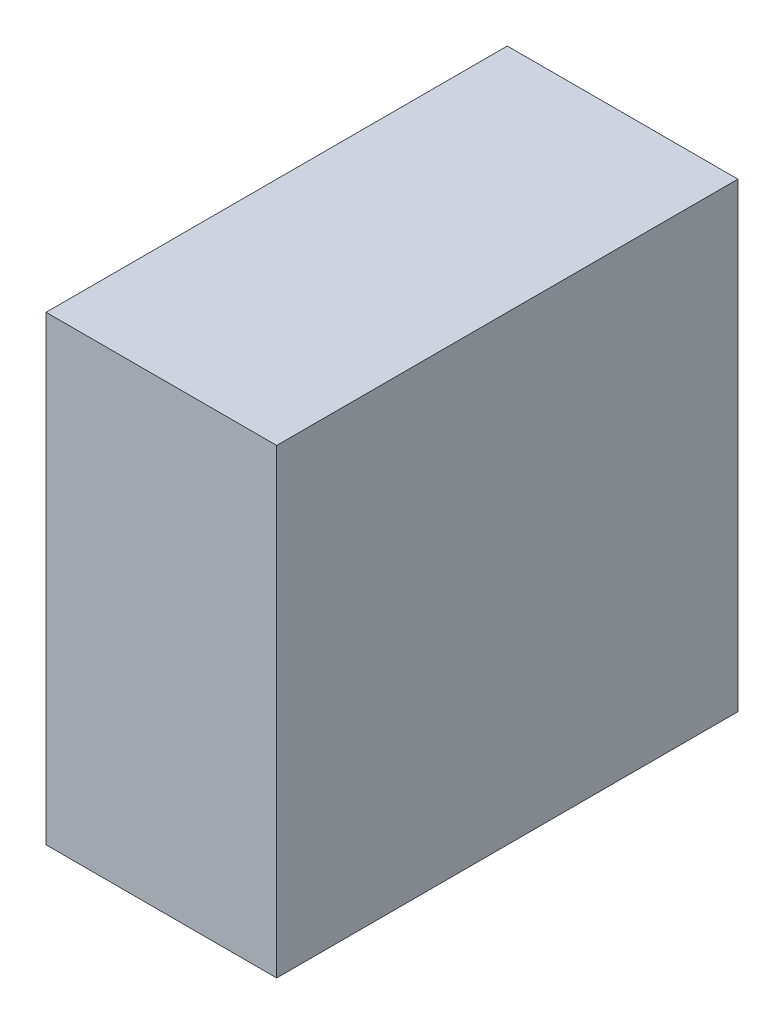
ISO-10303-21;
HEADER;
FILE_DESCRIPTION(('STEP AP214'),'2;1');
FILE_NAME('part.step','',(''),(''),'','','');
FILE_SCHEMA(('AUTOMOTIVE_DESIGN { 1 0 10303 214 1 1 1 1 }'));
ENDSEC;
DATA;
#1=APPLICATION_CONTEXT('core data for automotive mechanical design processes');
#2=APPLICATION_PROTOCOL_DEFINITION('international standard','automotive_design',2000,#1);
#3=PRODUCT_CONTEXT('',#1,'mechanical');
#4=PRODUCT('Part','Part','',(#3));
#5=PRODUCT_RELATED_PRODUCT_CATEGORY('part','',(#4));
#6=PRODUCT_DEFINITION_FORMATION('','',#4);
#7=PRODUCT_DEFINITION_CONTEXT('part definition',#1,'design');
#8=PRODUCT_DEFINITION('design','',#6,#7);
#9=PRODUCT_DEFINITION_SHAPE('','',#8);
#10=(LENGTH_UNIT() NAMED_UNIT(*) SI_UNIT(.MILLI.,.METRE.));
#11=(NAMED_UNIT(*) PLANE_ANGLE_UNIT() SI_UNIT($,.RADIAN.));
#12=(NAMED_UNIT(*) SI_UNIT($,.STERADIAN.) SOLID_ANGLE_UNIT());
#13=UNCERTAINTY_MEASURE_WITH_UNIT(LENGTH_MEASURE(1.E-05),#10,'distance_accuracy_value','');
#14=(GEOMETRIC_REPRESENTATION_CONTEXT(3) GLOBAL_UNCERTAINTY_ASSIGNED_CONTEXT((#13)) GLOBAL_UNIT_ASSIGNED_CONTEXT((#10,
#11,#12)) REPRESENTATION_CONTEXT('',''));
#15=CARTESIAN_POINT('',(0.,0.,0.));
#16=DIRECTION('',(0.,0.,1.));
#17=DIRECTION('',(1.,0.,0.));
#18=AXIS2_PLACEMENT_3D('',#15,#16,#17);
#19=CARTESIAN_POINT('',(0.,0.,0.));
#20=DIRECTION('',(0.894427190999916,-0.447213595499958,0.));
#21=DIRECTION('',(0.447213595499958,0.894427190999916,0.));
#22=AXIS2_PLACEMENT_3D('',#19,#20,#21);
#23=PLANE('',#22);
#24=DIRECTION('',(-0.447213595499958,-0.894427190999916,0.));
#25=VECTOR('',#24,1.);
#26=CARTESIAN_POINT('',(0.,0.,20.));
#27=LINE('',#26,#25);
#28=CARTESIAN_POINT('',(20.,40.,20.));
#29=VERTEX_POINT('',#28);
#30=CARTESIAN_POINT('',(0.,0.,20.));
#31=VERTEX_POINT('',#30);
#32=EDGE_CURVE('E81',#29,#31,#27,.T.);
#33=ORIENTED_EDGE('',*,*,#32,.F.);
#34=DIRECTION('',(0.,0.,1.));
#35=VECTOR('',#34,1.);
#36=CARTESIAN_POINT('',(20.,40.,0.));
#37=LINE('',#36,#35);
#38=CARTESIAN_POINT('',(20.,40.,0.));
#39=VERTEX_POINT('',#38);
#40=EDGE_CURVE('E56',#39,#29,#37,.T.);
#41=ORIENTED_EDGE('',*,*,#40,.F.);
#42=DIRECTION('',(0.447213595499958,0.894427190999916,0.));
#43=VECTOR('',#42,1.);
#44=CARTESIAN_POINT('',(0.,0.,0.));
#45=LINE('',#44,#43);
#46=CARTESIAN_POINT('',(0.,0.,0.));
#47=VERTEX_POINT('',#46);
#48=EDGE_CURVE('E93',#47,#39,#45,.T.);
#49=ORIENTED_EDGE('',*,*,#48,.F.);
#50=DIRECTION('',(0.,0.,-1.));
#51=VECTOR('',#50,1.);
#52=CARTESIAN_POINT('',(0.,0.,40.));
#53=LINE('',#52,#51);
#54=EDGE_CURVE('E11',#31,#47,#53,.T.);
#55=ORIENTED_EDGE('',*,*,#54,.F.);
#56=EDGE_LOOP('',(#33,#41,#49,#55));
#57=FACE_BOUND('',#56,.T.);
#58=ADVANCED_FACE('F33',(#57),#23,.F.);
#59=CARTESIAN_POINT('',(0.,0.,40.));
#60=DIRECTION('',(0.,1.,0.));
#61=DIRECTION('',(0.,0.,1.));
#62=AXIS2_PLACEMENT_3D('',#59,#60,#61);
#63=PLANE('',#62);
#64=DIRECTION('',(1.,0.,0.));
#65=VECTOR('',#64,1.);
#66=CARTESIAN_POINT('',(0.,0.,40.));
#67=LINE('',#66,#65);
#68=CARTESIAN_POINT('',(20.,0.,40.));
#69=VERTEX_POINT('',#68);
#70=CARTESIAN_POINT('',(40.,0.,40.));
#71=VERTEX_POINT('',#70);
#72=EDGE_CURVE('E115',#69,#71,#67,.T.);
#73=ORIENTED_EDGE('',*,*,#72,.F.);
#74=DIRECTION('',(0.,0.,1.));
#75=VECTOR('',#74,1.);
#76=CARTESIAN_POINT('',(20.,0.,20.));
#77=LINE('',#76,#75);
#78=CARTESIAN_POINT('',(20.,0.,20.));
#79=VERTEX_POINT('',#78);
#80=EDGE_CURVE('E91',#79,#69,#77,.T.);
#81=ORIENTED_EDGE('',*,*,#80,.F.);
#82=DIRECTION('',(1.,0.,0.));
#83=VECTOR('',#82,1.);
#84=CARTESIAN_POINT('',(20.,0.,20.));
#85=LINE('',#84,#83);
#86=EDGE_CURVE('E84',#31,#79,#85,.T.);
#87=ORIENTED_EDGE('',*,*,#86,.F.);
#88=ORIENTED_EDGE('',*,*,#54,.T.);
#89=DIRECTION('',(1.,0.,0.));
#90=VECTOR('',#89,1.);
#91=CARTESIAN_POINT('',(0.,0.,0.));
#92=LINE('',#91,#90);
#93=CARTESIAN_POINT('',(40.,0.,0.));
#94=VERTEX_POINT('',#93);
#95=EDGE_CURVE('E101',#47,#94,#92,.T.);
#96=ORIENTED_EDGE('',*,*,#95,.T.);
#97=DIRECTION('',(0.,0.,-1.));
#98=VECTOR('',#97,1.);
#99=CARTESIAN_POINT('',(40.,0.,40.));
#100=LINE('',#99,#98);
#101=EDGE_CURVE('E41',#71,#94,#100,.T.);
#102=ORIENTED_EDGE('',*,*,#101,.F.);
#103=EDGE_LOOP('',(#73,#81,#87,#88,#96,#102));
#104=FACE_BOUND('',#103,.T.);
#105=ADVANCED_FACE('F35',(#104),#63,.F.);
#106=CARTESIAN_POINT('',(40.,0.,40.));
#107=DIRECTION('',(-1.,0.,0.));
#108=DIRECTION('',(0.,0.,1.));
#109=AXIS2_PLACEMENT_3D('',#106,#107,#108);
#110=PLANE('',#109);
#111=DIRECTION('',(0.,1.,0.));
#112=VECTOR('',#111,1.);
#113=CARTESIAN_POINT('',(40.,0.,0.));
#114=LINE('',#113,#112);
#115=CARTESIAN_POINT('',(40.,40.,0.));
#116=VERTEX_POINT('',#115);
#117=EDGE_CURVE('E103',#94,#116,#114,.T.);
#118=ORIENTED_EDGE('',*,*,#117,.T.);
#119=DIRECTION('',(0.,0.,-1.));
#120=VECTOR('',#119,1.);
#121=CARTESIAN_POINT('',(40.,40.,40.));
#122=LINE('',#121,#120);
#123=CARTESIAN_POINT('',(40.,40.,40.));
#124=VERTEX_POINT('',#123);
#125=EDGE_CURVE('E116',#124,#116,#122,.T.);
#126=ORIENTED_EDGE('',*,*,#125,.F.);
#127=DIRECTION('',(0.,1.,0.));
#128=VECTOR('',#127,1.);
#129=CARTESIAN_POINT('',(40.,0.,40.));
#130=LINE('',#129,#128);
#131=EDGE_CURVE('E122',#71,#124,#130,.T.);
#132=ORIENTED_EDGE('',*,*,#131,.F.);
#133=ORIENTED_EDGE('',*,*,#101,.T.);
#134=EDGE_LOOP('',(#118,#126,#132,#133));
#135=FACE_BOUND('',#134,.T.);
#136=ADVANCED_FACE('F120',(#135),#110,.F.);
#137=CARTESIAN_POINT('',(0.,40.,40.));
#138=DIRECTION('',(0.,-1.,0.));
#139=DIRECTION('',(0.,0.,-1.));
#140=AXIS2_PLACEMENT_3D('',#137,#138,#139);
#141=PLANE('',#140);
#142=DIRECTION('',(-1.,0.,0.));
#143=VECTOR('',#142,1.);
#144=CARTESIAN_POINT('',(0.,40.,0.));
#145=LINE('',#144,#143);
#146=EDGE_CURVE('E107',#116,#39,#145,.T.);
#147=ORIENTED_EDGE('',*,*,#146,.T.);
#148=ORIENTED_EDGE('',*,*,#40,.T.);
#149=DIRECTION('',(0.,0.,1.));
#150=VECTOR('',#149,1.);
#151=CARTESIAN_POINT('',(20.,40.,20.));
#152=LINE('',#151,#150);
#153=CARTESIAN_POINT('',(20.,40.,40.));
#154=VERTEX_POINT('',#153);
#155=EDGE_CURVE('E98',#29,#154,#152,.T.);
#156=ORIENTED_EDGE('',*,*,#155,.T.);
#157=DIRECTION('',(-1.,0.,0.));
#158=VECTOR('',#157,1.);
#159=CARTESIAN_POINT('',(0.,40.,40.));
#160=LINE('',#159,#158);
#161=EDGE_CURVE('E111',#124,#154,#160,.T.);
#162=ORIENTED_EDGE('',*,*,#161,.F.);
#163=ORIENTED_EDGE('',*,*,#125,.T.);
#164=EDGE_LOOP('',(#147,#148,#156,#162,#163));
#165=FACE_BOUND('',#164,.T.);
#166=ADVANCED_FACE('F136',(#165),#141,.F.);
#167=CARTESIAN_POINT('',(0.,0.,40.));
#168=DIRECTION('',(0.,0.,-1.));
#169=DIRECTION('',(-1.,0.,0.));
#170=AXIS2_PLACEMENT_3D('',#167,#168,#169);
#171=PLANE('',#170);
#172=ORIENTED_EDGE('',*,*,#161,.T.);
#173=DIRECTION('',(0.,1.,0.));
#174=VECTOR('',#173,1.);
#175=CARTESIAN_POINT('',(20.,40.,40.));
#176=LINE('',#175,#174);
#177=EDGE_CURVE('E86',#69,#154,#176,.T.);
#178=ORIENTED_EDGE('',*,*,#177,.F.);
#179=ORIENTED_EDGE('',*,*,#72,.T.);
#180=ORIENTED_EDGE('',*,*,#131,.T.);
#181=EDGE_LOOP('',(#172,#178,#179,#180));
#182=FACE_BOUND('',#181,.T.);
#183=ADVANCED_FACE('F137',(#182),#171,.F.);
#184=CARTESIAN_POINT('',(0.,0.,0.));
#185=DIRECTION('',(0.,0.,-1.));
#186=DIRECTION('',(-1.,0.,0.));
#187=AXIS2_PLACEMENT_3D('',#184,#185,#186);
#188=PLANE('',#187);
#189=ORIENTED_EDGE('',*,*,#48,.T.);
#190=ORIENTED_EDGE('',*,*,#146,.F.);
#191=ORIENTED_EDGE('',*,*,#117,.F.);
#192=ORIENTED_EDGE('',*,*,#95,.F.);
#193=EDGE_LOOP('',(#189,#190,#191,#192));
#194=FACE_BOUND('',#193,.T.);
#195=ADVANCED_FACE('F102',(#194),#188,.T.);
#196=CARTESIAN_POINT('',(20.,40.,20.));
#197=DIRECTION('',(1.,0.,0.));
#198=DIRECTION('',(0.,0.,-1.));
#199=AXIS2_PLACEMENT_3D('',#196,#197,#198);
#200=PLANE('',#199);
#201=ORIENTED_EDGE('',*,*,#177,.T.);
#202=ORIENTED_EDGE('',*,*,#155,.F.);
#203=DIRECTION('',(0.,1.,0.));
#204=VECTOR('',#203,1.);
#205=CARTESIAN_POINT('',(20.,40.,20.));
#206=LINE('',#205,#204);
#207=EDGE_CURVE('E48',#79,#29,#206,.T.);
#208=ORIENTED_EDGE('',*,*,#207,.F.);
#209=ORIENTED_EDGE('',*,*,#80,.T.);
#210=EDGE_LOOP('',(#201,#202,#208,#209));
#211=FACE_BOUND('',#210,.T.);
#212=ADVANCED_FACE('F132',(#211),#200,.F.);
#213=CARTESIAN_POINT('',(0.,0.,20.));
#214=DIRECTION('',(0.,0.,1.));
#215=DIRECTION('',(1.,0.,0.));
#216=AXIS2_PLACEMENT_3D('',#213,#214,#215);
#217=PLANE('',#216);
#218=ORIENTED_EDGE('',*,*,#32,.T.);
#219=ORIENTED_EDGE('',*,*,#86,.T.);
#220=ORIENTED_EDGE('',*,*,#207,.T.);
#221=EDGE_LOOP('',(#218,#219,#220));
#222=FACE_BOUND('',#221,.T.);
#223=ADVANCED_FACE('F83',(#222),#217,.T.);
#224=CLOSED_SHELL('',(#58,#105,#136,#166,#183,#195,#212,#223));
#225=MANIFOLD_SOLID_BREP('B2',#224);
#226=ADVANCED_BREP_SHAPE_REPRESENTATION('',(#18,#225),#14);
#227=SHAPE_DEFINITION_REPRESENTATION(#9,#226);
ENDSEC;
END-ISO-10303-21;
